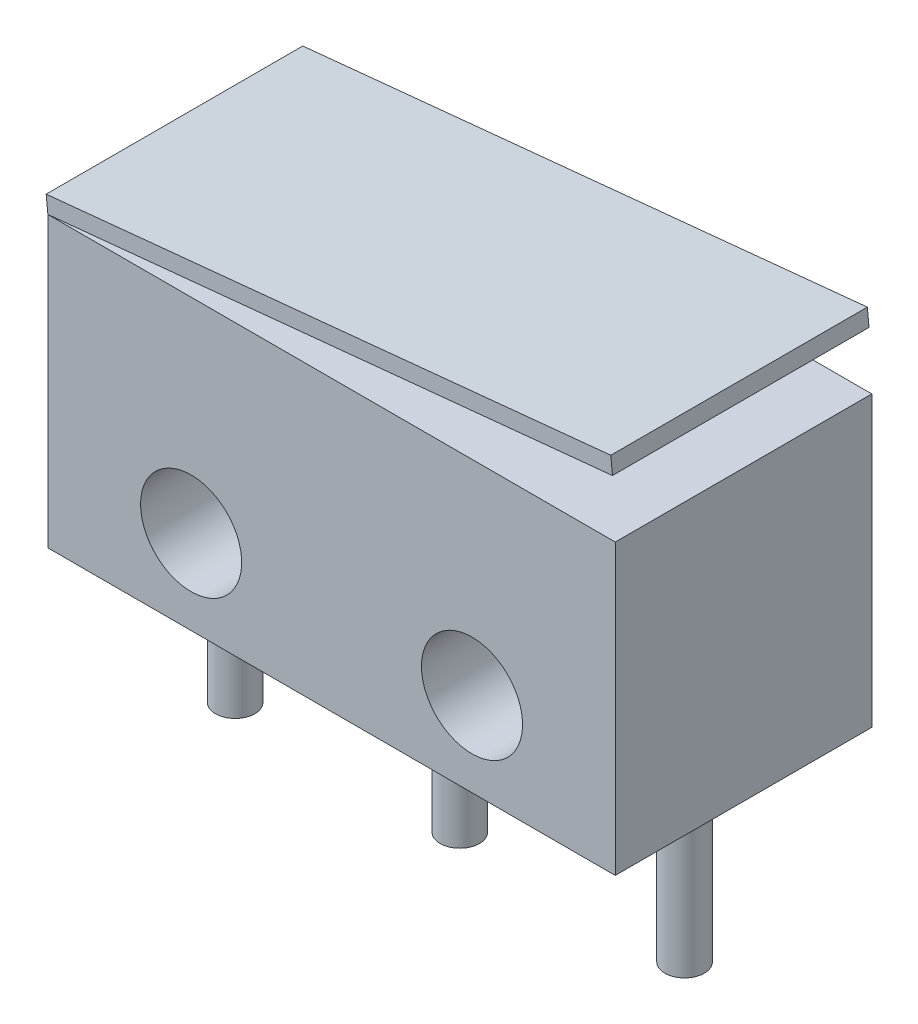
ISO-10303-21;
HEADER;
FILE_DESCRIPTION(('STEP AP214'),'2;1');
FILE_NAME('part.step','',(''),(''),'','','');
FILE_SCHEMA(('AUTOMOTIVE_DESIGN { 1 0 10303 214 1 1 1 1 }'));
ENDSEC;
DATA;
#1=APPLICATION_CONTEXT('core data for automotive mechanical design processes');
#2=APPLICATION_PROTOCOL_DEFINITION('international standard','automotive_design',2000,#1);
#3=PRODUCT_CONTEXT('',#1,'mechanical');
#4=PRODUCT('Part','Part','',(#3));
#5=PRODUCT_RELATED_PRODUCT_CATEGORY('part','',(#4));
#6=PRODUCT_DEFINITION_FORMATION('','',#4);
#7=PRODUCT_DEFINITION_CONTEXT('part definition',#1,'design');
#8=PRODUCT_DEFINITION('design','',#6,#7);
#9=PRODUCT_DEFINITION_SHAPE('','',#8);
#10=(LENGTH_UNIT() NAMED_UNIT(*) SI_UNIT(.MILLI.,.METRE.));
#11=(NAMED_UNIT(*) PLANE_ANGLE_UNIT() SI_UNIT($,.RADIAN.));
#12=(NAMED_UNIT(*) SI_UNIT($,.STERADIAN.) SOLID_ANGLE_UNIT());
#13=UNCERTAINTY_MEASURE_WITH_UNIT(LENGTH_MEASURE(1.E-05),#10,'distance_accuracy_value','');
#14=(GEOMETRIC_REPRESENTATION_CONTEXT(3) GLOBAL_UNCERTAINTY_ASSIGNED_CONTEXT((#13)) GLOBAL_UNIT_ASSIGNED_CONTEXT((#10,
#11,#12)) REPRESENTATION_CONTEXT('',''));
#15=CARTESIAN_POINT('',(0.,0.,0.));
#16=DIRECTION('',(0.,0.,1.));
#17=DIRECTION('',(1.,0.,0.));
#18=AXIS2_PLACEMENT_3D('',#15,#16,#17);
#19=CARTESIAN_POINT('',(6.36312554976152,7.35236396839308,0.));
#20=DIRECTION('',(0.,0.,1.));
#21=DIRECTION('',(1.,0.,0.));
#22=AXIS2_PLACEMENT_3D('',#19,#20,#21);
#23=PLANE('',#22);
#24=CARTESIAN_POINT('',(0.,6.52779999999999,0.));
#25=CARTESIAN_POINT('',(12.7639738718003,7.7978,0.));
#26=B_SPLINE_CURVE_WITH_KNOTS('',1,(#24,#25),.UNSPECIFIED.,.F.,.F.,(2,2),(0.,1.),.UNSPECIFIED.);
#27=CARTESIAN_POINT('',(0.,6.5278,0.));
#28=VERTEX_POINT('',#27);
#29=CARTESIAN_POINT('',(12.7639737059525,7.79779998349835,0.));
#30=VERTEX_POINT('',#29);
#31=EDGE_CURVE('P0_E60',#28,#30,#26,.T.);
#32=ORIENTED_EDGE('',*,*,#31,.F.);
#33=DIRECTION('',(0.0990099009900995,-0.995086448257603,0.));
#34=VECTOR('',#33,1.);
#35=CARTESIAN_POINT('',(0.,6.5278,0.));
#36=LINE('',#35,#34);
#37=CARTESIAN_POINT('',(-0.0377227722772305,6.90692793678615,0.));
#38=VERTEX_POINT('',#37);
#39=EDGE_CURVE('P0_E20',#38,#28,#36,.T.);
#40=ORIENTED_EDGE('',*,*,#39,.F.);
#41=DIRECTION('',(-0.995086448257603,-0.0990099009900994,0.));
#42=VECTOR('',#41,1.);
#43=CARTESIAN_POINT('',(12.726251099523,8.17692793678615,0.));
#44=LINE('',#43,#42);
#45=CARTESIAN_POINT('',(12.726251099523,8.17692793678615,0.));
#46=VERTEX_POINT('',#45);
#47=EDGE_CURVE('P0_E57',#46,#38,#44,.T.);
#48=ORIENTED_EDGE('',*,*,#47,.F.);
#49=DIRECTION('',(-0.0990099009900957,0.995086448257603,0.));
#50=VECTOR('',#49,1.);
#51=CARTESIAN_POINT('',(12.726251099523,8.17692793678615,0.));
#52=LINE('',#51,#50);
#53=EDGE_CURVE('P0_E71',#30,#46,#52,.T.);
#54=ORIENTED_EDGE('',*,*,#53,.F.);
#55=EDGE_LOOP('',(#32,#40,#48,#54));
#56=FACE_BOUND('',#55,.T.);
#57=ADVANCED_FACE('P0_F16',(#56),#23,.F.);
#58=CARTESIAN_POINT('',(12.726251099523,8.17692793678615,5.8));
#59=DIRECTION('',(0.995086448257603,0.0990099009900957,0.));
#60=DIRECTION('',(-0.0990099009900957,0.995086448257603,0.));
#61=AXIS2_PLACEMENT_3D('',#58,#59,#60);
#62=PLANE('',#61);
#63=DIRECTION('',(-0.0990099009902853,0.995086448257584,0.));
#64=VECTOR('',#63,1.);
#65=CARTESIAN_POINT('',(12.7639738718003,7.7978,5.8));
#66=LINE('',#65,#64);
#67=CARTESIAN_POINT('',(12.7639737059525,7.79779998349835,5.8));
#68=VERTEX_POINT('',#67);
#69=CARTESIAN_POINT('',(12.726251099523,8.17692793678615,5.8));
#70=VERTEX_POINT('',#69);
#71=EDGE_CURVE('P0_E87',#68,#70,#66,.T.);
#72=ORIENTED_EDGE('',*,*,#71,.F.);
#73=CARTESIAN_POINT('',(12.7639738718003,7.7978,0.));
#74=CARTESIAN_POINT('',(12.7639738718003,7.7978,5.8));
#75=B_SPLINE_CURVE_WITH_KNOTS('',1,(#73,#74),.UNSPECIFIED.,.F.,.F.,(2,2),(0.,1.),.UNSPECIFIED.);
#76=EDGE_CURVE('P0_E27',#30,#68,#75,.T.);
#77=ORIENTED_EDGE('',*,*,#76,.F.);
#78=ORIENTED_EDGE('',*,*,#53,.T.);
#79=DIRECTION('',(0.,0.,1.));
#80=VECTOR('',#79,1.);
#81=CARTESIAN_POINT('',(12.726251099523,8.17692793678615,5.8));
#82=LINE('',#81,#80);
#83=EDGE_CURVE('P0_E69',#46,#70,#82,.T.);
#84=ORIENTED_EDGE('',*,*,#83,.T.);
#85=EDGE_LOOP('',(#72,#77,#78,#84));
#86=FACE_BOUND('',#85,.T.);
#87=ADVANCED_FACE('P0_F92',(#86),#62,.T.);
#88=CARTESIAN_POINT('',(6.36312554976152,7.35236396839308,5.8));
#89=DIRECTION('',(0.,0.,1.));
#90=DIRECTION('',(1.,0.,0.));
#91=AXIS2_PLACEMENT_3D('',#88,#89,#90);
#92=PLANE('',#91);
#93=DIRECTION('',(-0.995086448257603,-0.0990099009900994,0.));
#94=VECTOR('',#93,1.);
#95=CARTESIAN_POINT('',(12.726251099523,8.17692793678615,5.8));
#96=LINE('',#95,#94);
#97=CARTESIAN_POINT('',(-0.0377227722772305,6.90692793678615,5.8));
#98=VERTEX_POINT('',#97);
#99=EDGE_CURVE('P0_E82',#70,#98,#96,.T.);
#100=ORIENTED_EDGE('',*,*,#99,.T.);
#101=DIRECTION('',(0.0990099009900995,-0.995086448257603,0.));
#102=VECTOR('',#101,1.);
#103=CARTESIAN_POINT('',(0.,6.5278,5.8));
#104=LINE('',#103,#102);
#105=CARTESIAN_POINT('',(0.,6.5278,5.79999983333333));
#106=VERTEX_POINT('',#105);
#107=EDGE_CURVE('P0_E74',#106,#98,#104,.F.);
#108=ORIENTED_EDGE('',*,*,#107,.F.);
#109=CARTESIAN_POINT('',(0.,6.52779999999999,5.8));
#110=CARTESIAN_POINT('',(12.7639738718003,7.7978,5.8));
#111=B_SPLINE_CURVE_WITH_KNOTS('',1,(#109,#110),.UNSPECIFIED.,.F.,.F.,(2,2),(0.,1.),.UNSPECIFIED.);
#112=EDGE_CURVE('P0_E11',#106,#68,#111,.T.);
#113=ORIENTED_EDGE('',*,*,#112,.T.);
#114=ORIENTED_EDGE('',*,*,#71,.T.);
#115=EDGE_LOOP('',(#100,#108,#113,#114));
#116=FACE_BOUND('',#115,.T.);
#117=ADVANCED_FACE('P0_F120',(#116),#92,.T.);
#118=CARTESIAN_POINT('',(0.,6.5278,5.8));
#119=DIRECTION('',(-0.995086448257603,-0.0990099009900995,0.));
#120=DIRECTION('',(0.0990099009900995,-0.995086448257603,0.));
#121=AXIS2_PLACEMENT_3D('',#118,#119,#120);
#122=PLANE('',#121);
#123=ORIENTED_EDGE('',*,*,#107,.T.);
#124=DIRECTION('',(0.,0.,1.));
#125=VECTOR('',#124,1.);
#126=CARTESIAN_POINT('',(-0.0377227722772299,6.90692793678615,5.8));
#127=LINE('',#126,#125);
#128=EDGE_CURVE('P0_E67',#38,#98,#127,.T.);
#129=ORIENTED_EDGE('',*,*,#128,.F.);
#130=ORIENTED_EDGE('',*,*,#39,.T.);
#131=CARTESIAN_POINT('',(0.,6.52779999999999,0.));
#132=CARTESIAN_POINT('',(0.,6.52779999999999,5.8));
#133=B_SPLINE_CURVE_WITH_KNOTS('',1,(#131,#132),.UNSPECIFIED.,.F.,.F.,(2,2),(0.,1.),.UNSPECIFIED.);
#134=EDGE_CURVE('P0_E35',#28,#106,#133,.T.);
#135=ORIENTED_EDGE('',*,*,#134,.T.);
#136=EDGE_LOOP('',(#123,#129,#130,#135));
#137=FACE_BOUND('',#136,.T.);
#138=ADVANCED_FACE('P0_F73',(#137),#122,.T.);
#139=CARTESIAN_POINT('',(-0.0377227722772311,6.90692793678615,5.8));
#140=DIRECTION('',(-0.0990099009900995,0.995086448257603,0.));
#141=DIRECTION('',(-0.995086448257603,-0.0990099009900995,0.));
#142=AXIS2_PLACEMENT_3D('',#139,#140,#141);
#143=PLANE('',#142);
#144=ORIENTED_EDGE('',*,*,#99,.F.);
#145=ORIENTED_EDGE('',*,*,#83,.F.);
#146=ORIENTED_EDGE('',*,*,#47,.T.);
#147=ORIENTED_EDGE('',*,*,#128,.T.);
#148=EDGE_LOOP('',(#144,#145,#146,#147));
#149=FACE_BOUND('',#148,.T.);
#150=ADVANCED_FACE('P0_F18',(#149),#143,.T.);
#151=CARTESIAN_POINT('',(12.7639738718003,7.7978,5.8));
#152=DIRECTION('',(0.0990099009900993,-0.995086448257603,0.));
#153=DIRECTION('',(0.995086448257603,0.0990099009900993,0.));
#154=AXIS2_PLACEMENT_3D('',#151,#152,#153);
#155=PLANE('',#154);
#156=ORIENTED_EDGE('',*,*,#134,.F.);
#157=ORIENTED_EDGE('',*,*,#31,.T.);
#158=ORIENTED_EDGE('',*,*,#76,.T.);
#159=ORIENTED_EDGE('',*,*,#112,.F.);
#160=EDGE_LOOP('',(#156,#157,#158,#159));
#161=FACE_BOUND('',#160,.T.);
#162=ADVANCED_FACE('P0_F95',(#161),#155,.T.);
#163=CLOSED_SHELL('',(#57,#87,#117,#138,#150,#162));
#164=MANIFOLD_SOLID_BREP('P0_B1',#163);
#165=CARTESIAN_POINT('',(6.4135,3.2639,0.));
#166=DIRECTION('',(0.,0.,1.));
#167=DIRECTION('',(1.,0.,0.));
#168=AXIS2_PLACEMENT_3D('',#165,#166,#167);
#169=PLANE('',#168);
#170=CARTESIAN_POINT('',(9.5885,1.905,0.));
#171=DIRECTION('',(0.,0.,-1.));
#172=DIRECTION('',(-1.,0.,0.));
#173=AXIS2_PLACEMENT_3D('',#170,#171,#172);
#174=CIRCLE('',#173,1.143);
#175=CARTESIAN_POINT('',(8.4455,1.905,0.));
#176=VERTEX_POINT('',#175);
#177=EDGE_CURVE('P1_E146',#176,#176,#174,.F.);
#178=ORIENTED_EDGE('',*,*,#177,.T.);
#179=EDGE_LOOP('',(#178));
#180=FACE_BOUND('',#179,.T.);
#181=CARTESIAN_POINT('',(3.2385,1.905,0.));
#182=DIRECTION('',(0.,0.,-1.));
#183=DIRECTION('',(-1.,0.,0.));
#184=AXIS2_PLACEMENT_3D('',#181,#182,#183);
#185=CIRCLE('',#184,1.143);
#186=CARTESIAN_POINT('',(2.0955,1.905,0.));
#187=VERTEX_POINT('',#186);
#188=EDGE_CURVE('P1_E63',#187,#187,#185,.F.);
#189=ORIENTED_EDGE('',*,*,#188,.T.);
#190=EDGE_LOOP('',(#189));
#191=FACE_BOUND('',#190,.T.);
#192=CARTESIAN_POINT('',(0.,6.5278,0.));
#193=CARTESIAN_POINT('',(0.,0.,0.));
#194=B_SPLINE_CURVE_WITH_KNOTS('',1,(#192,#193),.UNSPECIFIED.,.F.,.F.,(2,2),(0.,1.),.UNSPECIFIED.);
#195=CARTESIAN_POINT('',(0.,6.5278,0.));
#196=VERTEX_POINT('',#195);
#197=CARTESIAN_POINT('',(0.,1.66666666721449E-07,0.));
#198=VERTEX_POINT('',#197);
#199=EDGE_CURVE('P1_E60',#196,#198,#194,.T.);
#200=ORIENTED_EDGE('',*,*,#199,.F.);
#201=DIRECTION('',(-1.,0.,0.));
#202=VECTOR('',#201,1.);
#203=CARTESIAN_POINT('',(12.827,6.5278,0.));
#204=LINE('',#203,#202);
#205=CARTESIAN_POINT('',(12.827,6.5278,0.));
#206=VERTEX_POINT('',#205);
#207=EDGE_CURVE('P1_E20',#206,#196,#204,.T.);
#208=ORIENTED_EDGE('',*,*,#207,.F.);
#209=DIRECTION('',(0.,1.,0.));
#210=VECTOR('',#209,1.);
#211=CARTESIAN_POINT('',(12.827,0.,0.));
#212=LINE('',#211,#210);
#213=CARTESIAN_POINT('',(12.827,0.,0.));
#214=VERTEX_POINT('',#213);
#215=EDGE_CURVE('P1_E57',#214,#206,#212,.T.);
#216=ORIENTED_EDGE('',*,*,#215,.F.);
#217=DIRECTION('',(1.,0.,0.));
#218=VECTOR('',#217,1.);
#219=CARTESIAN_POINT('',(0.,0.,0.));
#220=LINE('',#219,#218);
#221=EDGE_CURVE('P1_E73',#198,#214,#220,.T.);
#222=ORIENTED_EDGE('',*,*,#221,.F.);
#223=EDGE_LOOP('',(#200,#208,#216,#222));
#224=FACE_BOUND('',#223,.T.);
#225=ADVANCED_FACE('P1_F16',(#180,#191,#224),#169,.F.);
#226=CARTESIAN_POINT('',(0.,0.,0.));
#227=DIRECTION('',(0.,-1.,0.));
#228=DIRECTION('',(0.,0.,-1.));
#229=AXIS2_PLACEMENT_3D('',#226,#227,#228);
#230=PLANE('',#229);
#231=CARTESIAN_POINT('',(11.4935,0.,2.9));
#232=DIRECTION('',(0.,-1.,0.));
#233=DIRECTION('',(0.,0.,-1.));
#234=AXIS2_PLACEMENT_3D('',#231,#232,#233);
#235=CIRCLE('',#234,0.4445);
#236=CARTESIAN_POINT('',(11.4935,0.,2.4555));
#237=VERTEX_POINT('',#236);
#238=EDGE_CURVE('P1_E106',#237,#237,#235,.F.);
#239=ORIENTED_EDGE('',*,*,#238,.T.);
#240=EDGE_LOOP('',(#239));
#241=FACE_BOUND('',#240,.T.);
#242=CARTESIAN_POINT('',(1.3335,0.,2.9));
#243=DIRECTION('',(0.,-1.,0.));
#244=DIRECTION('',(0.,0.,-1.));
#245=AXIS2_PLACEMENT_3D('',#242,#243,#244);
#246=CIRCLE('',#245,0.4445);
#247=CARTESIAN_POINT('',(1.3335,0.,2.4555));
#248=VERTEX_POINT('',#247);
#249=EDGE_CURVE('P1_E111',#248,#248,#246,.F.);
#250=ORIENTED_EDGE('',*,*,#249,.T.);
#251=EDGE_LOOP('',(#250));
#252=FACE_BOUND('',#251,.T.);
#253=CARTESIAN_POINT('',(6.4135,0.,2.9));
#254=DIRECTION('',(0.,-1.,0.));
#255=DIRECTION('',(0.,0.,-1.));
#256=AXIS2_PLACEMENT_3D('',#253,#254,#255);
#257=CIRCLE('',#256,0.4445);
#258=CARTESIAN_POINT('',(6.4135,0.,2.4555));
#259=VERTEX_POINT('',#258);
#260=EDGE_CURVE('P1_E102',#259,#259,#257,.F.);
#261=ORIENTED_EDGE('',*,*,#260,.T.);
#262=EDGE_LOOP('',(#261));
#263=FACE_BOUND('',#262,.T.);
#264=DIRECTION('',(1.,0.,0.));
#265=VECTOR('',#264,1.);
#266=CARTESIAN_POINT('',(6.4135,0.,5.8));
#267=LINE('',#266,#265);
#268=CARTESIAN_POINT('',(0.,0.,5.8));
#269=VERTEX_POINT('',#268);
#270=CARTESIAN_POINT('',(12.827,0.,5.8));
#271=VERTEX_POINT('',#270);
#272=EDGE_CURVE('P1_E99',#269,#271,#267,.T.);
#273=ORIENTED_EDGE('',*,*,#272,.F.);
#274=CARTESIAN_POINT('',(0.,0.,0.));
#275=CARTESIAN_POINT('',(0.,0.,5.8));
#276=B_SPLINE_CURVE_WITH_KNOTS('',1,(#274,#275),.UNSPECIFIED.,.F.,.F.,(2,2),(0.,1.),.UNSPECIFIED.);
#277=EDGE_CURVE('P1_E27',#198,#269,#276,.T.);
#278=ORIENTED_EDGE('',*,*,#277,.F.);
#279=ORIENTED_EDGE('',*,*,#221,.T.);
#280=DIRECTION('',(0.,0.,1.));
#281=VECTOR('',#280,1.);
#282=CARTESIAN_POINT('',(12.827,0.,0.));
#283=LINE('',#282,#281);
#284=EDGE_CURVE('P1_E71',#271,#214,#283,.F.);
#285=ORIENTED_EDGE('',*,*,#284,.F.);
#286=EDGE_LOOP('',(#273,#278,#279,#285));
#287=FACE_BOUND('',#286,.T.);
#288=ADVANCED_FACE('P1_F179',(#241,#252,#263,#287),#230,.T.);
#289=CARTESIAN_POINT('',(6.4135,3.2639,5.8));
#290=DIRECTION('',(0.,0.,1.));
#291=DIRECTION('',(1.,0.,0.));
#292=AXIS2_PLACEMENT_3D('',#289,#290,#291);
#293=PLANE('',#292);
#294=CARTESIAN_POINT('',(9.5885,1.905,5.8));
#295=DIRECTION('',(0.,0.,-1.));
#296=DIRECTION('',(-1.,0.,0.));
#297=AXIS2_PLACEMENT_3D('',#294,#295,#296);
#298=CIRCLE('',#297,1.143);
#299=CARTESIAN_POINT('',(8.4455,1.905,5.8));
#300=VERTEX_POINT('',#299);
#301=EDGE_CURVE('P1_E125',#300,#300,#298,.T.);
#302=ORIENTED_EDGE('',*,*,#301,.T.);
#303=EDGE_LOOP('',(#302));
#304=FACE_BOUND('',#303,.T.);
#305=CARTESIAN_POINT('',(3.2385,1.905,5.8));
#306=DIRECTION('',(0.,0.,-1.));
#307=DIRECTION('',(-1.,0.,0.));
#308=AXIS2_PLACEMENT_3D('',#305,#306,#307);
#309=CIRCLE('',#308,1.143);
#310=CARTESIAN_POINT('',(2.0955,1.905,5.8));
#311=VERTEX_POINT('',#310);
#312=EDGE_CURVE('P1_E104',#311,#311,#309,.T.);
#313=ORIENTED_EDGE('',*,*,#312,.T.);
#314=EDGE_LOOP('',(#313));
#315=FACE_BOUND('',#314,.T.);
#316=DIRECTION('',(1.,0.,0.));
#317=VECTOR('',#316,1.);
#318=CARTESIAN_POINT('',(6.4135,6.5278,5.8));
#319=LINE('',#318,#317);
#320=CARTESIAN_POINT('',(12.827,6.5278,5.8));
#321=VERTEX_POINT('',#320);
#322=CARTESIAN_POINT('',(0.,6.5278,5.79999983333333));
#323=VERTEX_POINT('',#322);
#324=EDGE_CURVE('P1_E76',#321,#323,#319,.F.);
#325=ORIENTED_EDGE('',*,*,#324,.T.);
#326=CARTESIAN_POINT('',(0.,0.,5.8));
#327=CARTESIAN_POINT('',(0.,6.5278,5.8));
#328=B_SPLINE_CURVE_WITH_KNOTS('',1,(#326,#327),.UNSPECIFIED.,.F.,.F.,(2,2),(0.,1.),.UNSPECIFIED.);
#329=EDGE_CURVE('P1_E11',#269,#323,#328,.T.);
#330=ORIENTED_EDGE('',*,*,#329,.F.);
#331=ORIENTED_EDGE('',*,*,#272,.T.);
#332=DIRECTION('',(0.,1.,0.));
#333=VECTOR('',#332,1.);
#334=CARTESIAN_POINT('',(12.827,3.2639,5.8));
#335=LINE('',#334,#333);
#336=EDGE_CURVE('P1_E80',#271,#321,#335,.T.);
#337=ORIENTED_EDGE('',*,*,#336,.T.);
#338=EDGE_LOOP('',(#325,#330,#331,#337));
#339=FACE_BOUND('',#338,.T.);
#340=ADVANCED_FACE('P1_F133',(#304,#315,#339),#293,.T.);
#341=CARTESIAN_POINT('',(12.827,6.5278,0.));
#342=DIRECTION('',(0.,1.,0.));
#343=DIRECTION('',(-1.,0.,0.));
#344=AXIS2_PLACEMENT_3D('',#341,#342,#343);
#345=PLANE('',#344);
#346=ORIENTED_EDGE('',*,*,#324,.F.);
#347=DIRECTION('',(0.,0.,1.));
#348=VECTOR('',#347,1.);
#349=CARTESIAN_POINT('',(12.827,6.5278,0.));
#350=LINE('',#349,#348);
#351=EDGE_CURVE('P1_E69',#321,#206,#350,.F.);
#352=ORIENTED_EDGE('',*,*,#351,.T.);
#353=ORIENTED_EDGE('',*,*,#207,.T.);
#354=CARTESIAN_POINT('',(0.,6.5278,0.));
#355=CARTESIAN_POINT('',(0.,6.5278,5.8));
#356=B_SPLINE_CURVE_WITH_KNOTS('',1,(#354,#355),.UNSPECIFIED.,.F.,.F.,(2,2),(0.,1.),.UNSPECIFIED.);
#357=EDGE_CURVE('P1_E35',#196,#323,#356,.T.);
#358=ORIENTED_EDGE('',*,*,#357,.T.);
#359=EDGE_LOOP('',(#346,#352,#353,#358));
#360=FACE_BOUND('',#359,.T.);
#361=ADVANCED_FACE('P1_F75',(#360),#345,.T.);
#362=CARTESIAN_POINT('',(12.827,0.,0.));
#363=DIRECTION('',(1.,0.,0.));
#364=DIRECTION('',(0.,1.,0.));
#365=AXIS2_PLACEMENT_3D('',#362,#363,#364);
#366=PLANE('',#365);
#367=ORIENTED_EDGE('',*,*,#336,.F.);
#368=ORIENTED_EDGE('',*,*,#284,.T.);
#369=ORIENTED_EDGE('',*,*,#215,.T.);
#370=ORIENTED_EDGE('',*,*,#351,.F.);
#371=EDGE_LOOP('',(#367,#368,#369,#370));
#372=FACE_BOUND('',#371,.T.);
#373=ADVANCED_FACE('P1_F68',(#372),#366,.T.);
#374=CARTESIAN_POINT('',(9.5885,1.905,5.8));
#375=DIRECTION('',(0.,0.,-1.));
#376=DIRECTION('',(-1.,0.,0.));
#377=AXIS2_PLACEMENT_3D('',#374,#375,#376);
#378=CYLINDRICAL_SURFACE('',#377,1.143);
#379=ORIENTED_EDGE('',*,*,#301,.F.);
#380=EDGE_LOOP('',(#379));
#381=FACE_BOUND('',#380,.T.);
#382=ORIENTED_EDGE('',*,*,#177,.F.);
#383=EDGE_LOOP('',(#382));
#384=FACE_BOUND('',#383,.T.);
#385=ADVANCED_FACE('P1_F140',(#381,#384),#378,.F.);
#386=CARTESIAN_POINT('',(3.2385,1.905,5.8));
#387=DIRECTION('',(0.,0.,-1.));
#388=DIRECTION('',(-1.,0.,0.));
#389=AXIS2_PLACEMENT_3D('',#386,#387,#388);
#390=CYLINDRICAL_SURFACE('',#389,1.143);
#391=ORIENTED_EDGE('',*,*,#312,.F.);
#392=EDGE_LOOP('',(#391));
#393=FACE_BOUND('',#392,.T.);
#394=ORIENTED_EDGE('',*,*,#188,.F.);
#395=EDGE_LOOP('',(#394));
#396=FACE_BOUND('',#395,.T.);
#397=ADVANCED_FACE('P1_F136',(#393,#396),#390,.F.);
#398=CARTESIAN_POINT('',(11.4935,0.,2.9));
#399=DIRECTION('',(0.,-1.,0.));
#400=DIRECTION('',(0.,0.,-1.));
#401=AXIS2_PLACEMENT_3D('',#398,#399,#400);
#402=CYLINDRICAL_SURFACE('',#401,0.4445);
#403=ORIENTED_EDGE('',*,*,#238,.F.);
#404=EDGE_LOOP('',(#403));
#405=FACE_BOUND('',#404,.T.);
#406=CARTESIAN_POINT('',(11.4935,-3.81,2.9));
#407=DIRECTION('',(0.,-1.,0.));
#408=DIRECTION('',(0.,0.,-1.));
#409=AXIS2_PLACEMENT_3D('',#406,#407,#408);
#410=CIRCLE('',#409,0.4445);
#411=CARTESIAN_POINT('',(11.4935,-3.81,2.4555));
#412=VERTEX_POINT('',#411);
#413=EDGE_CURVE('P1_E79',#412,#412,#410,.F.);
#414=ORIENTED_EDGE('',*,*,#413,.T.);
#415=EDGE_LOOP('',(#414));
#416=FACE_BOUND('',#415,.T.);
#417=ADVANCED_FACE('P1_F139',(#405,#416),#402,.T.);
#418=CARTESIAN_POINT('',(1.3335,0.,2.9));
#419=DIRECTION('',(0.,-1.,0.));
#420=DIRECTION('',(0.,0.,-1.));
#421=AXIS2_PLACEMENT_3D('',#418,#419,#420);
#422=CYLINDRICAL_SURFACE('',#421,0.4445);
#423=ORIENTED_EDGE('',*,*,#249,.F.);
#424=EDGE_LOOP('',(#423));
#425=FACE_BOUND('',#424,.T.);
#426=CARTESIAN_POINT('',(1.3335,-3.81,2.9));
#427=DIRECTION('',(0.,-1.,0.));
#428=DIRECTION('',(0.,0.,-1.));
#429=AXIS2_PLACEMENT_3D('',#426,#427,#428);
#430=CIRCLE('',#429,0.4445);
#431=CARTESIAN_POINT('',(1.3335,-3.81,2.4555));
#432=VERTEX_POINT('',#431);
#433=EDGE_CURVE('P1_E87',#432,#432,#430,.F.);
#434=ORIENTED_EDGE('',*,*,#433,.T.);
#435=EDGE_LOOP('',(#434));
#436=FACE_BOUND('',#435,.T.);
#437=ADVANCED_FACE('P1_F208',(#425,#436),#422,.T.);
#438=CARTESIAN_POINT('',(6.4135,0.,2.9));
#439=DIRECTION('',(0.,-1.,0.));
#440=DIRECTION('',(0.,0.,-1.));
#441=AXIS2_PLACEMENT_3D('',#438,#439,#440);
#442=CYLINDRICAL_SURFACE('',#441,0.4445);
#443=ORIENTED_EDGE('',*,*,#260,.F.);
#444=EDGE_LOOP('',(#443));
#445=FACE_BOUND('',#444,.T.);
#446=CARTESIAN_POINT('',(6.4135,-3.81,2.9));
#447=DIRECTION('',(0.,-1.,0.));
#448=DIRECTION('',(0.,0.,-1.));
#449=AXIS2_PLACEMENT_3D('',#446,#447,#448);
#450=CIRCLE('',#449,0.4445);
#451=CARTESIAN_POINT('',(6.4135,-3.81,2.4555));
#452=VERTEX_POINT('',#451);
#453=EDGE_CURVE('P1_E95',#452,#452,#450,.F.);
#454=ORIENTED_EDGE('',*,*,#453,.T.);
#455=EDGE_LOOP('',(#454));
#456=FACE_BOUND('',#455,.T.);
#457=ADVANCED_FACE('P1_F206',(#445,#456),#442,.T.);
#458=CARTESIAN_POINT('',(11.4935,-3.81,2.9));
#459=DIRECTION('',(0.,1.,0.));
#460=DIRECTION('',(0.,0.,1.));
#461=AXIS2_PLACEMENT_3D('',#458,#459,#460);
#462=PLANE('',#461);
#463=ORIENTED_EDGE('',*,*,#413,.F.);
#464=EDGE_LOOP('',(#463));
#465=FACE_BOUND('',#464,.T.);
#466=ADVANCED_FACE('P1_F202',(#465),#462,.F.);
#467=CARTESIAN_POINT('',(1.3335,-3.81,2.9));
#468=DIRECTION('',(0.,1.,0.));
#469=DIRECTION('',(0.,0.,1.));
#470=AXIS2_PLACEMENT_3D('',#467,#468,#469);
#471=PLANE('',#470);
#472=ORIENTED_EDGE('',*,*,#433,.F.);
#473=EDGE_LOOP('',(#472));
#474=FACE_BOUND('',#473,.T.);
#475=ADVANCED_FACE('P1_F197',(#474),#471,.F.);
#476=CARTESIAN_POINT('',(6.4135,-3.81,2.9));
#477=DIRECTION('',(0.,1.,0.));
#478=DIRECTION('',(0.,0.,1.));
#479=AXIS2_PLACEMENT_3D('',#476,#477,#478);
#480=PLANE('',#479);
#481=ORIENTED_EDGE('',*,*,#453,.F.);
#482=EDGE_LOOP('',(#481));
#483=FACE_BOUND('',#482,.T.);
#484=ADVANCED_FACE('P1_F18',(#483),#480,.F.);
#485=CARTESIAN_POINT('',(0.,6.5278,0.));
#486=DIRECTION('',(-1.,0.,0.));
#487=DIRECTION('',(0.,-1.,0.));
#488=AXIS2_PLACEMENT_3D('',#485,#486,#487);
#489=PLANE('',#488);
#490=ORIENTED_EDGE('',*,*,#357,.F.);
#491=ORIENTED_EDGE('',*,*,#199,.T.);
#492=ORIENTED_EDGE('',*,*,#277,.T.);
#493=ORIENTED_EDGE('',*,*,#329,.T.);
#494=EDGE_LOOP('',(#490,#491,#492,#493));
#495=FACE_BOUND('',#494,.T.);
#496=ADVANCED_FACE('P1_F177',(#495),#489,.T.);
#497=CLOSED_SHELL('',(#225,#288,#340,#361,#373,#385,#397,#417,#437,#457,#466,#475,#484,#496));
#498=MANIFOLD_SOLID_BREP('P1_B1',#497);
#499=ADVANCED_BREP_SHAPE_REPRESENTATION('',(#18,#164,#498),#14);
#500=SHAPE_DEFINITION_REPRESENTATION(#9,#499);
ENDSEC;
END-ISO-10303-21;
